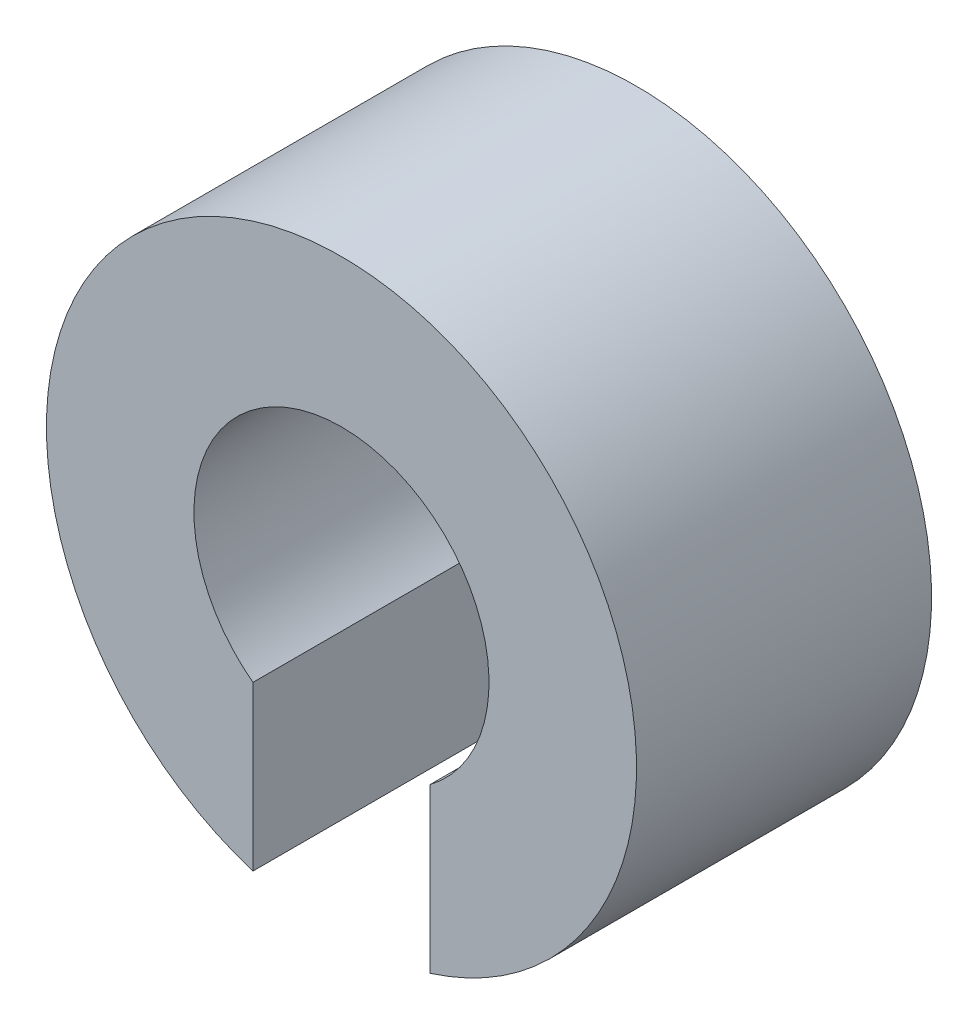
ISO-10303-21;
HEADER;
FILE_DESCRIPTION(('STEP AP214'),'2;1');
FILE_NAME('part.step','',(''),(''),'','','');
FILE_SCHEMA(('AUTOMOTIVE_DESIGN { 1 0 10303 214 1 1 1 1 }'));
ENDSEC;
DATA;
#1=APPLICATION_CONTEXT('core data for automotive mechanical design processes');
#2=APPLICATION_PROTOCOL_DEFINITION('international standard','automotive_design',2000,#1);
#3=PRODUCT_CONTEXT('',#1,'mechanical');
#4=PRODUCT('Part','Part','',(#3));
#5=PRODUCT_RELATED_PRODUCT_CATEGORY('part','',(#4));
#6=PRODUCT_DEFINITION_FORMATION('','',#4);
#7=PRODUCT_DEFINITION_CONTEXT('part definition',#1,'design');
#8=PRODUCT_DEFINITION('design','',#6,#7);
#9=PRODUCT_DEFINITION_SHAPE('','',#8);
#10=(LENGTH_UNIT() NAMED_UNIT(*) SI_UNIT(.MILLI.,.METRE.));
#11=(NAMED_UNIT(*) PLANE_ANGLE_UNIT() SI_UNIT($,.RADIAN.));
#12=(NAMED_UNIT(*) SI_UNIT($,.STERADIAN.) SOLID_ANGLE_UNIT());
#13=UNCERTAINTY_MEASURE_WITH_UNIT(LENGTH_MEASURE(1.E-05),#10,'distance_accuracy_value','');
#14=(GEOMETRIC_REPRESENTATION_CONTEXT(3) GLOBAL_UNCERTAINTY_ASSIGNED_CONTEXT((#13)) GLOBAL_UNIT_ASSIGNED_CONTEXT((#10,
#11,#12)) REPRESENTATION_CONTEXT('',''));
#15=CARTESIAN_POINT('',(0.,0.,0.));
#16=DIRECTION('',(0.,0.,1.));
#17=DIRECTION('',(1.,0.,0.));
#18=AXIS2_PLACEMENT_3D('',#15,#16,#17);
#19=CARTESIAN_POINT('',(0.,0.,5.));
#20=DIRECTION('',(0.,0.,-1.));
#21=DIRECTION('',(-1.,0.,0.));
#22=AXIS2_PLACEMENT_3D('',#19,#20,#21);
#23=CYLINDRICAL_SURFACE('',#22,5.);
#24=CARTESIAN_POINT('',(0.,0.,0.));
#25=DIRECTION('',(0.,0.,1.));
#26=DIRECTION('',(1.,0.,0.));
#27=AXIS2_PLACEMENT_3D('',#24,#25,#26);
#28=CIRCLE('',#27,5.);
#29=CARTESIAN_POINT('',(1.5,-4.76969600708473,0.));
#30=VERTEX_POINT('',#29);
#31=CARTESIAN_POINT('',(-1.5,-4.76969600708473,0.));
#32=VERTEX_POINT('',#31);
#33=EDGE_CURVE('E94',#30,#32,#28,.T.);
#34=ORIENTED_EDGE('',*,*,#33,.T.);
#35=DIRECTION('',(0.,0.,-1.));
#36=VECTOR('',#35,1.);
#37=CARTESIAN_POINT('',(-1.5,-4.76969600708473,5.));
#38=LINE('',#37,#36);
#39=CARTESIAN_POINT('',(-1.5,-4.76969600708473,5.));
#40=VERTEX_POINT('',#39);
#41=EDGE_CURVE('E11',#40,#32,#38,.T.);
#42=ORIENTED_EDGE('',*,*,#41,.F.);
#43=CARTESIAN_POINT('',(0.,0.,5.));
#44=DIRECTION('',(0.,0.,1.));
#45=DIRECTION('',(1.,0.,0.));
#46=AXIS2_PLACEMENT_3D('',#43,#44,#45);
#47=CIRCLE('',#46,5.);
#48=CARTESIAN_POINT('',(1.5,-4.76969600708473,5.));
#49=VERTEX_POINT('',#48);
#50=EDGE_CURVE('E82',#49,#40,#47,.T.);
#51=ORIENTED_EDGE('',*,*,#50,.F.);
#52=DIRECTION('',(0.,0.,-1.));
#53=VECTOR('',#52,1.);
#54=CARTESIAN_POINT('',(1.5,-4.76969600708473,5.));
#55=LINE('',#54,#53);
#56=EDGE_CURVE('E90',#49,#30,#55,.T.);
#57=ORIENTED_EDGE('',*,*,#56,.T.);
#58=EDGE_LOOP('',(#34,#42,#51,#57));
#59=FACE_BOUND('',#58,.T.);
#60=ADVANCED_FACE('F31',(#59),#23,.T.);
#61=CARTESIAN_POINT('',(-1.5,-4.76969600708473,5.));
#62=DIRECTION('',(-1.,0.,0.));
#63=DIRECTION('',(0.,-1.,0.));
#64=AXIS2_PLACEMENT_3D('',#61,#62,#63);
#65=PLANE('',#64);
#66=DIRECTION('',(0.,1.,0.));
#67=VECTOR('',#66,1.);
#68=CARTESIAN_POINT('',(-1.5,-4.76969600708473,0.));
#69=LINE('',#68,#67);
#70=CARTESIAN_POINT('',(-1.5,-2.,0.));
#71=VERTEX_POINT('',#70);
#72=EDGE_CURVE('E86',#32,#71,#69,.T.);
#73=ORIENTED_EDGE('',*,*,#72,.T.);
#74=DIRECTION('',(0.,0.,-1.));
#75=VECTOR('',#74,1.);
#76=CARTESIAN_POINT('',(-1.5,-2.,5.));
#77=LINE('',#76,#75);
#78=CARTESIAN_POINT('',(-1.5,-2.,5.));
#79=VERTEX_POINT('',#78);
#80=EDGE_CURVE('E39',#79,#71,#77,.T.);
#81=ORIENTED_EDGE('',*,*,#80,.F.);
#82=DIRECTION('',(0.,1.,0.));
#83=VECTOR('',#82,1.);
#84=CARTESIAN_POINT('',(-1.5,-4.76969600708473,5.));
#85=LINE('',#84,#83);
#86=EDGE_CURVE('E77',#40,#79,#85,.T.);
#87=ORIENTED_EDGE('',*,*,#86,.F.);
#88=ORIENTED_EDGE('',*,*,#41,.T.);
#89=EDGE_LOOP('',(#73,#81,#87,#88));
#90=FACE_BOUND('',#89,.T.);
#91=ADVANCED_FACE('F85',(#90),#65,.F.);
#92=CARTESIAN_POINT('',(0.,0.,5.));
#93=DIRECTION('',(0.,0.,-1.));
#94=DIRECTION('',(-1.,0.,0.));
#95=AXIS2_PLACEMENT_3D('',#92,#93,#94);
#96=CYLINDRICAL_SURFACE('',#95,2.5);
#97=CARTESIAN_POINT('',(0.,0.,0.));
#98=DIRECTION('',(0.,0.,-1.));
#99=DIRECTION('',(1.,0.,0.));
#100=AXIS2_PLACEMENT_3D('',#97,#98,#99);
#101=CIRCLE('',#100,2.5);
#102=CARTESIAN_POINT('',(1.5,-2.,0.));
#103=VERTEX_POINT('',#102);
#104=EDGE_CURVE('E64',#71,#103,#101,.T.);
#105=ORIENTED_EDGE('',*,*,#104,.T.);
#106=DIRECTION('',(0.,0.,-1.));
#107=VECTOR('',#106,1.);
#108=CARTESIAN_POINT('',(1.5,-2.,5.));
#109=LINE('',#108,#107);
#110=CARTESIAN_POINT('',(1.5,-2.,5.));
#111=VERTEX_POINT('',#110);
#112=EDGE_CURVE('E87',#111,#103,#109,.T.);
#113=ORIENTED_EDGE('',*,*,#112,.F.);
#114=CARTESIAN_POINT('',(0.,0.,5.));
#115=DIRECTION('',(0.,0.,-1.));
#116=DIRECTION('',(1.,0.,0.));
#117=AXIS2_PLACEMENT_3D('',#114,#115,#116);
#118=CIRCLE('',#117,2.5);
#119=EDGE_CURVE('E80',#79,#111,#118,.T.);
#120=ORIENTED_EDGE('',*,*,#119,.F.);
#121=ORIENTED_EDGE('',*,*,#80,.T.);
#122=EDGE_LOOP('',(#105,#113,#120,#121));
#123=FACE_BOUND('',#122,.T.);
#124=ADVANCED_FACE('F88',(#123),#96,.F.);
#125=CARTESIAN_POINT('',(1.5,-4.76969600708473,5.));
#126=DIRECTION('',(1.,0.,0.));
#127=DIRECTION('',(0.,1.,0.));
#128=AXIS2_PLACEMENT_3D('',#125,#126,#127);
#129=PLANE('',#128);
#130=DIRECTION('',(0.,-1.,0.));
#131=VECTOR('',#130,1.);
#132=CARTESIAN_POINT('',(1.5,-4.76969600708473,0.));
#133=LINE('',#132,#131);
#134=EDGE_CURVE('E70',#103,#30,#133,.T.);
#135=ORIENTED_EDGE('',*,*,#134,.T.);
#136=ORIENTED_EDGE('',*,*,#56,.F.);
#137=DIRECTION('',(0.,-1.,0.));
#138=VECTOR('',#137,1.);
#139=CARTESIAN_POINT('',(1.5,-4.76969600708473,5.));
#140=LINE('',#139,#138);
#141=EDGE_CURVE('E47',#111,#49,#140,.T.);
#142=ORIENTED_EDGE('',*,*,#141,.F.);
#143=ORIENTED_EDGE('',*,*,#112,.T.);
#144=EDGE_LOOP('',(#135,#136,#142,#143));
#145=FACE_BOUND('',#144,.T.);
#146=ADVANCED_FACE('F101',(#145),#129,.F.);
#147=CARTESIAN_POINT('',(0.,0.,5.));
#148=DIRECTION('',(0.,0.,1.));
#149=DIRECTION('',(1.,0.,0.));
#150=AXIS2_PLACEMENT_3D('',#147,#148,#149);
#151=PLANE('',#150);
#152=ORIENTED_EDGE('',*,*,#50,.T.);
#153=ORIENTED_EDGE('',*,*,#86,.T.);
#154=ORIENTED_EDGE('',*,*,#119,.T.);
#155=ORIENTED_EDGE('',*,*,#141,.T.);
#156=EDGE_LOOP('',(#152,#153,#154,#155));
#157=FACE_BOUND('',#156,.T.);
#158=ADVANCED_FACE('F78',(#157),#151,.T.);
#159=CARTESIAN_POINT('',(0.,0.,0.));
#160=DIRECTION('',(0.,0.,1.));
#161=DIRECTION('',(1.,0.,0.));
#162=AXIS2_PLACEMENT_3D('',#159,#160,#161);
#163=PLANE('',#162);
#164=ORIENTED_EDGE('',*,*,#33,.F.);
#165=ORIENTED_EDGE('',*,*,#134,.F.);
#166=ORIENTED_EDGE('',*,*,#104,.F.);
#167=ORIENTED_EDGE('',*,*,#72,.F.);
#168=EDGE_LOOP('',(#164,#165,#166,#167));
#169=FACE_BOUND('',#168,.T.);
#170=ADVANCED_FACE('F104',(#169),#163,.F.);
#171=CLOSED_SHELL('',(#60,#91,#124,#146,#158,#170));
#172=MANIFOLD_SOLID_BREP('B2',#171);
#173=ADVANCED_BREP_SHAPE_REPRESENTATION('',(#18,#172),#14);
#174=SHAPE_DEFINITION_REPRESENTATION(#9,#173);
ENDSEC;
END-ISO-10303-21;
